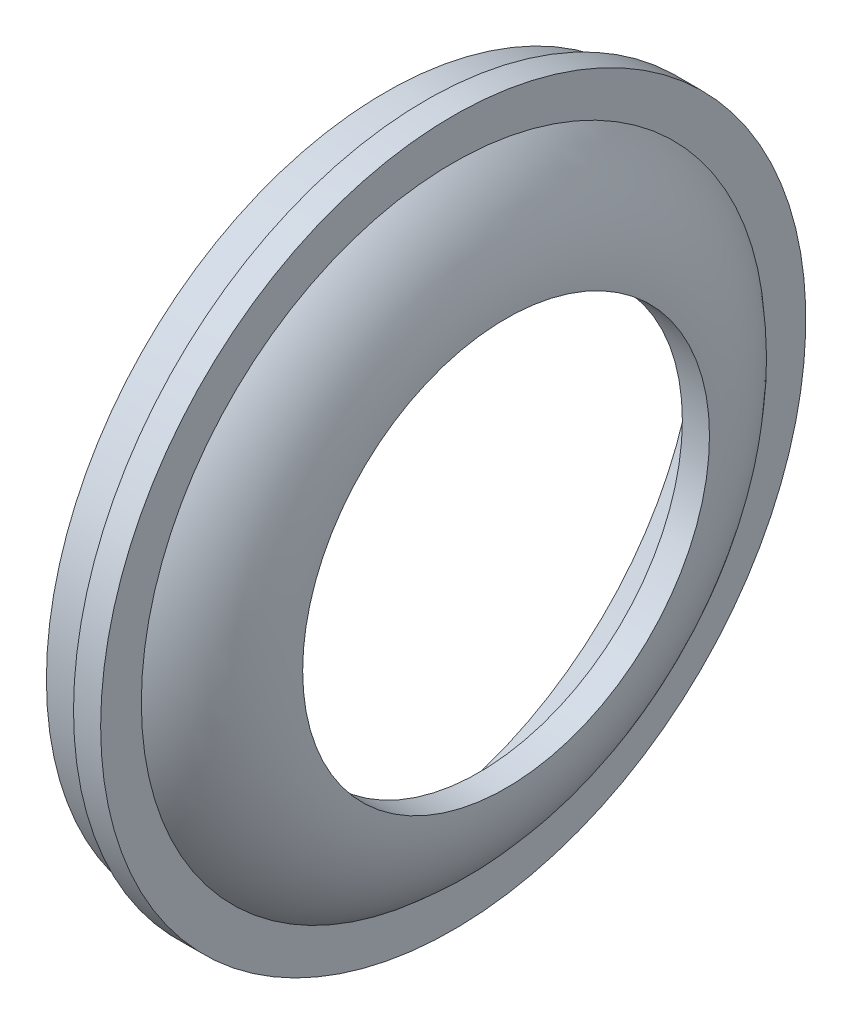
ISO-10303-21;
HEADER;
FILE_DESCRIPTION(('STEP AP214'),'2;1');
FILE_NAME('part.step','',(''),(''),'','','');
FILE_SCHEMA(('AUTOMOTIVE_DESIGN { 1 0 10303 214 1 1 1 1 }'));
ENDSEC;
DATA;
#1=APPLICATION_CONTEXT('core data for automotive mechanical design processes');
#2=APPLICATION_PROTOCOL_DEFINITION('international standard','automotive_design',2000,#1);
#3=PRODUCT_CONTEXT('',#1,'mechanical');
#4=PRODUCT('Part','Part','',(#3));
#5=PRODUCT_RELATED_PRODUCT_CATEGORY('part','',(#4));
#6=PRODUCT_DEFINITION_FORMATION('','',#4);
#7=PRODUCT_DEFINITION_CONTEXT('part definition',#1,'design');
#8=PRODUCT_DEFINITION('design','',#6,#7);
#9=PRODUCT_DEFINITION_SHAPE('','',#8);
#10=(LENGTH_UNIT() NAMED_UNIT(*) SI_UNIT(.MILLI.,.METRE.));
#11=(NAMED_UNIT(*) PLANE_ANGLE_UNIT() SI_UNIT($,.RADIAN.));
#12=(NAMED_UNIT(*) SI_UNIT($,.STERADIAN.) SOLID_ANGLE_UNIT());
#13=UNCERTAINTY_MEASURE_WITH_UNIT(LENGTH_MEASURE(1.E-05),#10,'distance_accuracy_value','');
#14=(GEOMETRIC_REPRESENTATION_CONTEXT(3) GLOBAL_UNCERTAINTY_ASSIGNED_CONTEXT((#13)) GLOBAL_UNIT_ASSIGNED_CONTEXT((#10,
#11,#12)) REPRESENTATION_CONTEXT('',''));
#15=CARTESIAN_POINT('',(0.,0.,0.));
#16=DIRECTION('',(0.,0.,1.));
#17=DIRECTION('',(1.,0.,0.));
#18=AXIS2_PLACEMENT_3D('',#15,#16,#17);
#19=CARTESIAN_POINT('',(-4.69142469272207,0.,0.));
#20=DIRECTION('',(-1.,0.,0.));
#21=DIRECTION('',(0.,0.,1.));
#22=AXIS2_PLACEMENT_3D('',#19,#20,#21);
#23=TOROIDAL_SURFACE('',#22,15.,10.1601833514452);
#24=CARTESIAN_POINT('',(1.5719071470405,0.,0.));
#25=DIRECTION('',(-1.,0.,0.));
#26=DIRECTION('',(0.,0.,1.));
#27=AXIS2_PLACEMENT_3D('',#24,#25,#26);
#28=CIRCLE('',#27,23.);
#29=CARTESIAN_POINT('',(1.5719071470405,0.,23.));
#30=VERTEX_POINT('',#29);
#31=EDGE_CURVE('E10',#30,#30,#28,.T.);
#32=ORIENTED_EDGE('',*,*,#31,.F.);
#33=EDGE_LOOP('',(#32));
#34=FACE_BOUND('',#33,.T.);
#35=CARTESIAN_POINT('',(5.4687586587231,0.,0.));
#36=DIRECTION('',(-1.,0.,0.));
#37=DIRECTION('',(0.,0.,1.));
#38=AXIS2_PLACEMENT_3D('',#35,#36,#37);
#39=CIRCLE('',#38,15.);
#40=CARTESIAN_POINT('',(5.4687586587231,0.,15.));
#41=VERTEX_POINT('',#40);
#42=EDGE_CURVE('E46',#41,#41,#39,.T.);
#43=ORIENTED_EDGE('',*,*,#42,.T.);
#44=EDGE_LOOP('',(#43));
#45=FACE_BOUND('',#44,.T.);
#46=ADVANCED_FACE('F39',(#34,#45),#23,.T.);
#47=CARTESIAN_POINT('',(-17.3655928529595,0.,0.));
#48=DIRECTION('',(-1.,0.,0.));
#49=DIRECTION('',(0.,0.,1.));
#50=AXIS2_PLACEMENT_3D('',#47,#48,#49);
#51=CYLINDRICAL_SURFACE('',#50,15.);
#52=ORIENTED_EDGE('',*,*,#42,.F.);
#53=EDGE_LOOP('',(#52));
#54=FACE_BOUND('',#53,.T.);
#55=CARTESIAN_POINT('',(3.4687586587231,0.,0.));
#56=DIRECTION('',(-1.,0.,0.));
#57=DIRECTION('',(0.,0.,1.));
#58=AXIS2_PLACEMENT_3D('',#55,#56,#57);
#59=CIRCLE('',#58,15.);
#60=CARTESIAN_POINT('',(3.4687586587231,0.,15.));
#61=VERTEX_POINT('',#60);
#62=EDGE_CURVE('E51',#61,#61,#59,.T.);
#63=ORIENTED_EDGE('',*,*,#62,.T.);
#64=EDGE_LOOP('',(#63));
#65=FACE_BOUND('',#64,.T.);
#66=ADVANCED_FACE('F95',(#54,#65),#51,.F.);
#67=CARTESIAN_POINT('',(-4.69142469272207,0.,0.));
#68=DIRECTION('',(-1.,0.,0.));
#69=DIRECTION('',(0.,0.,1.));
#70=AXIS2_PLACEMENT_3D('',#67,#68,#69);
#71=TOROIDAL_SURFACE('',#70,15.,8.16018335144517);
#72=ORIENTED_EDGE('',*,*,#62,.F.);
#73=EDGE_LOOP('',(#72));
#74=FACE_BOUND('',#73,.T.);
#75=CARTESIAN_POINT('',(0.338990058222081,0.,0.));
#76=DIRECTION('',(-1.,0.,0.));
#77=DIRECTION('',(0.,0.,1.));
#78=AXIS2_PLACEMENT_3D('',#75,#76,#77);
#79=CIRCLE('',#78,21.4252252694117);
#80=CARTESIAN_POINT('',(0.338990058222081,0.,21.4252252694117));
#81=VERTEX_POINT('',#80);
#82=EDGE_CURVE('E56',#81,#81,#79,.T.);
#83=ORIENTED_EDGE('',*,*,#82,.T.);
#84=EDGE_LOOP('',(#83));
#85=FACE_BOUND('',#84,.T.);
#86=ADVANCED_FACE('F100',(#74,#85),#71,.F.);
#87=CARTESIAN_POINT('',(-3.4280928529595,0.,0.));
#88=DIRECTION('',(-1.,0.,0.));
#89=DIRECTION('',(0.,0.,1.));
#90=AXIS2_PLACEMENT_3D('',#87,#88,#89);
#91=CONICAL_SURFACE('',#90,23.,0.395956973169553);
#92=ORIENTED_EDGE('',*,*,#82,.F.);
#93=EDGE_LOOP('',(#92));
#94=FACE_BOUND('',#93,.T.);
#95=CARTESIAN_POINT('',(-3.4280928529595,0.,0.));
#96=DIRECTION('',(-1.,0.,0.));
#97=DIRECTION('',(0.,0.,1.));
#98=AXIS2_PLACEMENT_3D('',#95,#96,#97);
#99=CIRCLE('',#98,23.);
#100=CARTESIAN_POINT('',(-3.4280928529595,0.,23.));
#101=VERTEX_POINT('',#100);
#102=EDGE_CURVE('E62',#101,#101,#99,.T.);
#103=ORIENTED_EDGE('',*,*,#102,.T.);
#104=EDGE_LOOP('',(#103));
#105=FACE_BOUND('',#104,.T.);
#106=ADVANCED_FACE('F105',(#94,#105),#91,.F.);
#107=CARTESIAN_POINT('',(-3.4280928529595,0.,-25.));
#108=DIRECTION('',(1.,0.,0.));
#109=DIRECTION('',(0.,0.,-1.));
#110=AXIS2_PLACEMENT_3D('',#107,#108,#109);
#111=PLANE('',#110);
#112=ORIENTED_EDGE('',*,*,#102,.F.);
#113=EDGE_LOOP('',(#112));
#114=FACE_BOUND('',#113,.T.);
#115=CARTESIAN_POINT('',(-3.4280928529595,0.,0.));
#116=DIRECTION('',(-1.,0.,0.));
#117=DIRECTION('',(0.,0.,1.));
#118=AXIS2_PLACEMENT_3D('',#115,#116,#117);
#119=CIRCLE('',#118,25.);
#120=CARTESIAN_POINT('',(-3.4280928529595,0.,25.));
#121=VERTEX_POINT('',#120);
#122=EDGE_CURVE('E66',#121,#121,#119,.T.);
#123=ORIENTED_EDGE('',*,*,#122,.T.);
#124=EDGE_LOOP('',(#123));
#125=FACE_BOUND('',#124,.T.);
#126=ADVANCED_FACE('F112',(#114,#125),#111,.F.);
#127=CARTESIAN_POINT('',(-17.3655928529595,0.,0.));
#128=DIRECTION('',(-1.,0.,0.));
#129=DIRECTION('',(0.,0.,1.));
#130=AXIS2_PLACEMENT_3D('',#127,#128,#129);
#131=CYLINDRICAL_SURFACE('',#130,25.);
#132=ORIENTED_EDGE('',*,*,#122,.F.);
#133=EDGE_LOOP('',(#132));
#134=FACE_BOUND('',#133,.T.);
#135=CARTESIAN_POINT('',(-0.428092852959503,0.,0.));
#136=DIRECTION('',(-1.,0.,0.));
#137=DIRECTION('',(0.,0.,1.));
#138=AXIS2_PLACEMENT_3D('',#135,#136,#137);
#139=CIRCLE('',#138,25.);
#140=CARTESIAN_POINT('',(-0.428092852959503,0.,25.));
#141=VERTEX_POINT('',#140);
#142=EDGE_CURVE('E70',#141,#141,#139,.T.);
#143=ORIENTED_EDGE('',*,*,#142,.T.);
#144=EDGE_LOOP('',(#143));
#145=FACE_BOUND('',#144,.T.);
#146=ADVANCED_FACE('F116',(#134,#145),#131,.T.);
#147=CARTESIAN_POINT('',(-0.428092852959503,0.,-26.));
#148=DIRECTION('',(1.,0.,0.));
#149=DIRECTION('',(0.,0.,-1.));
#150=AXIS2_PLACEMENT_3D('',#147,#148,#149);
#151=PLANE('',#150);
#152=ORIENTED_EDGE('',*,*,#142,.F.);
#153=EDGE_LOOP('',(#152));
#154=FACE_BOUND('',#153,.T.);
#155=CARTESIAN_POINT('',(-0.428092852959503,0.,0.));
#156=DIRECTION('',(-1.,0.,0.));
#157=DIRECTION('',(0.,0.,1.));
#158=AXIS2_PLACEMENT_3D('',#155,#156,#157);
#159=CIRCLE('',#158,26.);
#160=CARTESIAN_POINT('',(-0.428092852959503,0.,26.));
#161=VERTEX_POINT('',#160);
#162=EDGE_CURVE('E74',#161,#161,#159,.T.);
#163=ORIENTED_EDGE('',*,*,#162,.T.);
#164=EDGE_LOOP('',(#163));
#165=FACE_BOUND('',#164,.T.);
#166=ADVANCED_FACE('F91',(#154,#165),#151,.F.);
#167=CARTESIAN_POINT('',(-17.3655928529595,0.,0.));
#168=DIRECTION('',(-1.,0.,0.));
#169=DIRECTION('',(0.,0.,1.));
#170=AXIS2_PLACEMENT_3D('',#167,#168,#169);
#171=CYLINDRICAL_SURFACE('',#170,26.);
#172=ORIENTED_EDGE('',*,*,#162,.F.);
#173=EDGE_LOOP('',(#172));
#174=FACE_BOUND('',#173,.T.);
#175=CARTESIAN_POINT('',(1.5719071470405,0.,0.));
#176=DIRECTION('',(-1.,0.,0.));
#177=DIRECTION('',(0.,0.,1.));
#178=AXIS2_PLACEMENT_3D('',#175,#176,#177);
#179=CIRCLE('',#178,26.);
#180=CARTESIAN_POINT('',(1.5719071470405,0.,26.));
#181=VERTEX_POINT('',#180);
#182=EDGE_CURVE('E78',#181,#181,#179,.T.);
#183=ORIENTED_EDGE('',*,*,#182,.T.);
#184=EDGE_LOOP('',(#183));
#185=FACE_BOUND('',#184,.T.);
#186=ADVANCED_FACE('F83',(#174,#185),#171,.T.);
#187=CARTESIAN_POINT('',(1.5719071470405,0.,-25.));
#188=DIRECTION('',(-1.,0.,0.));
#189=DIRECTION('',(0.,0.,1.));
#190=AXIS2_PLACEMENT_3D('',#187,#188,#189);
#191=PLANE('',#190);
#192=ORIENTED_EDGE('',*,*,#182,.F.);
#193=EDGE_LOOP('',(#192));
#194=FACE_BOUND('',#193,.T.);
#195=ORIENTED_EDGE('',*,*,#31,.T.);
#196=EDGE_LOOP('',(#195));
#197=FACE_BOUND('',#196,.T.);
#198=ADVANCED_FACE('F85',(#194,#197),#191,.F.);
#199=CLOSED_SHELL('',(#46,#66,#86,#106,#126,#146,#166,#186,#198));
#200=MANIFOLD_SOLID_BREP('B2',#199);
#201=ADVANCED_BREP_SHAPE_REPRESENTATION('',(#18,#200),#14);
#202=SHAPE_DEFINITION_REPRESENTATION(#9,#201);
ENDSEC;
END-ISO-10303-21;
